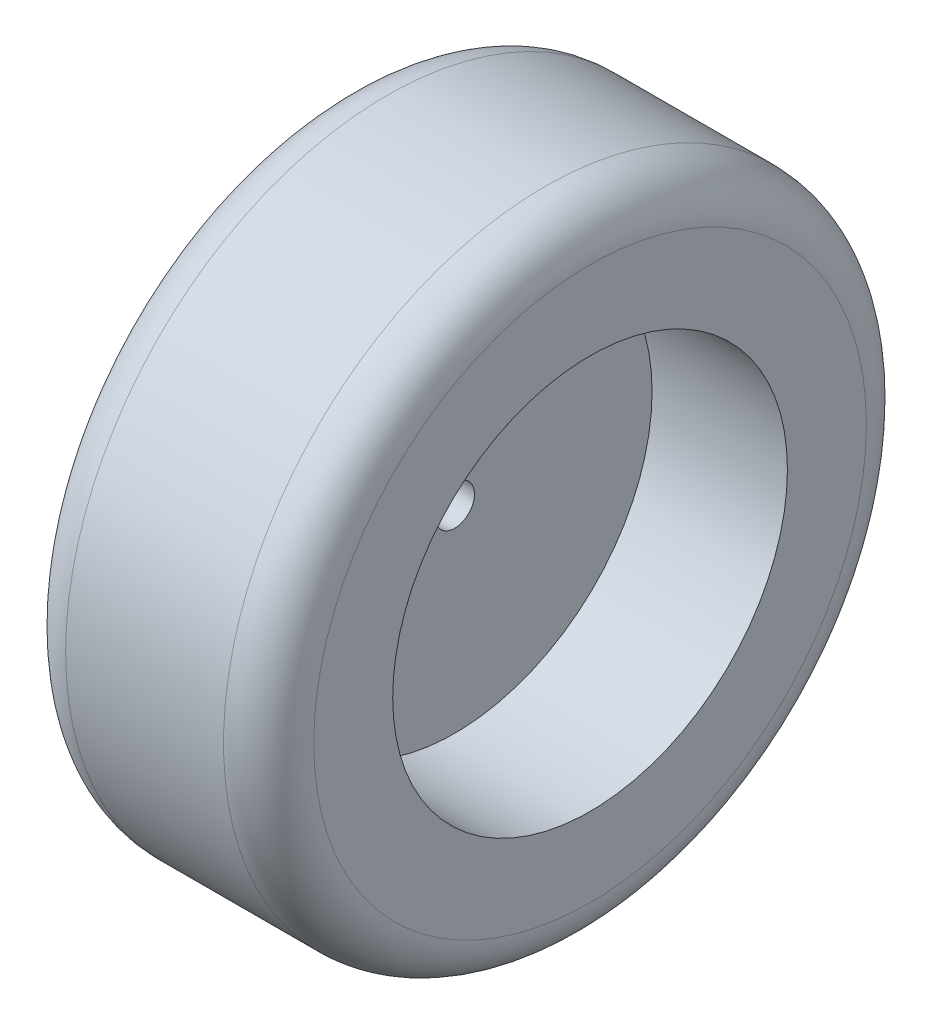
ISO-10303-21;
HEADER;
FILE_DESCRIPTION(('STEP AP214'),'2;1');
FILE_NAME('part.step','',(''),(''),'','','');
FILE_SCHEMA(('AUTOMOTIVE_DESIGN { 1 0 10303 214 1 1 1 1 }'));
ENDSEC;
DATA;
#1=APPLICATION_CONTEXT('core data for automotive mechanical design processes');
#2=APPLICATION_PROTOCOL_DEFINITION('international standard','automotive_design',2000,#1);
#3=PRODUCT_CONTEXT('',#1,'mechanical');
#4=PRODUCT('Part','Part','',(#3));
#5=PRODUCT_RELATED_PRODUCT_CATEGORY('part','',(#4));
#6=PRODUCT_DEFINITION_FORMATION('','',#4);
#7=PRODUCT_DEFINITION_CONTEXT('part definition',#1,'design');
#8=PRODUCT_DEFINITION('design','',#6,#7);
#9=PRODUCT_DEFINITION_SHAPE('','',#8);
#10=(LENGTH_UNIT() NAMED_UNIT(*) SI_UNIT(.MILLI.,.METRE.));
#11=(NAMED_UNIT(*) PLANE_ANGLE_UNIT() SI_UNIT($,.RADIAN.));
#12=(NAMED_UNIT(*) SI_UNIT($,.STERADIAN.) SOLID_ANGLE_UNIT());
#13=UNCERTAINTY_MEASURE_WITH_UNIT(LENGTH_MEASURE(1.E-05),#10,'distance_accuracy_value','');
#14=(GEOMETRIC_REPRESENTATION_CONTEXT(3) GLOBAL_UNCERTAINTY_ASSIGNED_CONTEXT((#13)) GLOBAL_UNIT_ASSIGNED_CONTEXT((#10,
#11,#12)) REPRESENTATION_CONTEXT('',''));
#15=CARTESIAN_POINT('',(0.,0.,0.));
#16=DIRECTION('',(0.,0.,1.));
#17=DIRECTION('',(1.,0.,0.));
#18=AXIS2_PLACEMENT_3D('',#15,#16,#17);
#19=CARTESIAN_POINT('',(11.,0.,0.));
#20=DIRECTION('',(1.,0.,0.));
#21=DIRECTION('',(0.,0.,-1.));
#22=AXIS2_PLACEMENT_3D('',#19,#20,#21);
#23=PLANE('',#22);
#24=CARTESIAN_POINT('',(11.,0.,0.));
#25=DIRECTION('',(1.,0.,0.));
#26=DIRECTION('',(0.,0.,-1.));
#27=AXIS2_PLACEMENT_3D('',#24,#25,#26);
#28=CIRCLE('',#27,17.5);
#29=CARTESIAN_POINT('',(11.,0.,-17.5));
#30=VERTEX_POINT('',#29);
#31=EDGE_CURVE('E58',#30,#30,#28,.T.);
#32=ORIENTED_EDGE('',*,*,#31,.F.);
#33=EDGE_LOOP('',(#32));
#34=FACE_BOUND('',#33,.T.);
#35=CARTESIAN_POINT('',(11.,0.,0.));
#36=DIRECTION('',(1.,0.,0.));
#37=DIRECTION('',(0.,0.,-1.));
#38=AXIS2_PLACEMENT_3D('',#35,#36,#37);
#39=CIRCLE('',#38,24.5);
#40=CARTESIAN_POINT('',(11.,0.,-24.5));
#41=VERTEX_POINT('',#40);
#42=EDGE_CURVE('E54',#41,#41,#39,.T.);
#43=ORIENTED_EDGE('',*,*,#42,.T.);
#44=EDGE_LOOP('',(#43));
#45=FACE_BOUND('',#44,.T.);
#46=ADVANCED_FACE('F37',(#34,#45),#23,.T.);
#47=CARTESIAN_POINT('',(-11.,0.,0.));
#48=DIRECTION('',(-1.,0.,0.));
#49=DIRECTION('',(0.,0.,1.));
#50=AXIS2_PLACEMENT_3D('',#47,#48,#49);
#51=PLANE('',#50);
#52=CARTESIAN_POINT('',(-11.,0.,0.));
#53=DIRECTION('',(-1.,0.,0.));
#54=DIRECTION('',(0.,0.,1.));
#55=AXIS2_PLACEMENT_3D('',#52,#53,#54);
#56=CIRCLE('',#55,17.5);
#57=CARTESIAN_POINT('',(-11.,0.,17.5));
#58=VERTEX_POINT('',#57);
#59=EDGE_CURVE('E66',#58,#58,#56,.T.);
#60=ORIENTED_EDGE('',*,*,#59,.F.);
#61=EDGE_LOOP('',(#60));
#62=FACE_BOUND('',#61,.T.);
#63=CARTESIAN_POINT('',(-11.,0.,0.));
#64=DIRECTION('',(-1.,0.,0.));
#65=DIRECTION('',(0.,0.,1.));
#66=AXIS2_PLACEMENT_3D('',#63,#64,#65);
#67=CIRCLE('',#66,24.5);
#68=CARTESIAN_POINT('',(-11.,0.,24.5));
#69=VERTEX_POINT('',#68);
#70=EDGE_CURVE('E11',#69,#69,#67,.T.);
#71=ORIENTED_EDGE('',*,*,#70,.T.);
#72=EDGE_LOOP('',(#71));
#73=FACE_BOUND('',#72,.T.);
#74=ADVANCED_FACE('F89',(#62,#73),#51,.T.);
#75=CARTESIAN_POINT('',(11.,0.,0.));
#76=DIRECTION('',(1.,0.,0.));
#77=DIRECTION('',(0.,0.,-1.));
#78=AXIS2_PLACEMENT_3D('',#75,#76,#77);
#79=CYLINDRICAL_SURFACE('',#78,28.5);
#80=CARTESIAN_POINT('',(7.00000000000001,0.,0.));
#81=DIRECTION('',(1.,0.,0.));
#82=DIRECTION('',(0.,0.,-1.));
#83=AXIS2_PLACEMENT_3D('',#80,#81,#82);
#84=CIRCLE('',#83,28.5);
#85=CARTESIAN_POINT('',(7.,0.,-28.5));
#86=VERTEX_POINT('',#85);
#87=EDGE_CURVE('E45',#86,#86,#84,.F.);
#88=ORIENTED_EDGE('',*,*,#87,.T.);
#89=EDGE_LOOP('',(#88));
#90=FACE_BOUND('',#89,.T.);
#91=CARTESIAN_POINT('',(-6.99999999999999,0.,0.));
#92=DIRECTION('',(-1.,0.,0.));
#93=DIRECTION('',(0.,0.,1.));
#94=AXIS2_PLACEMENT_3D('',#91,#92,#93);
#95=CIRCLE('',#94,28.5);
#96=CARTESIAN_POINT('',(-6.99999999999999,0.,28.5));
#97=VERTEX_POINT('',#96);
#98=EDGE_CURVE('E49',#97,#97,#95,.F.);
#99=ORIENTED_EDGE('',*,*,#98,.T.);
#100=EDGE_LOOP('',(#99));
#101=FACE_BOUND('',#100,.T.);
#102=ADVANCED_FACE('F95',(#90,#101),#79,.T.);
#103=CARTESIAN_POINT('',(7.00000000000001,0.,0.));
#104=DIRECTION('',(1.,0.,0.));
#105=DIRECTION('',(0.,0.,-1.));
#106=AXIS2_PLACEMENT_3D('',#103,#104,#105);
#107=TOROIDAL_SURFACE('',#106,24.5,4.);
#108=ORIENTED_EDGE('',*,*,#87,.F.);
#109=EDGE_LOOP('',(#108));
#110=FACE_BOUND('',#109,.T.);
#111=ORIENTED_EDGE('',*,*,#42,.F.);
#112=EDGE_LOOP('',(#111));
#113=FACE_BOUND('',#112,.T.);
#114=ADVANCED_FACE('F101',(#110,#113),#107,.T.);
#115=CARTESIAN_POINT('',(-6.99999999999999,0.,0.));
#116=DIRECTION('',(-1.,0.,0.));
#117=DIRECTION('',(0.,0.,1.));
#118=AXIS2_PLACEMENT_3D('',#115,#116,#117);
#119=TOROIDAL_SURFACE('',#118,24.5,4.);
#120=ORIENTED_EDGE('',*,*,#70,.F.);
#121=EDGE_LOOP('',(#120));
#122=FACE_BOUND('',#121,.T.);
#123=ORIENTED_EDGE('',*,*,#98,.F.);
#124=EDGE_LOOP('',(#123));
#125=FACE_BOUND('',#124,.T.);
#126=ADVANCED_FACE('F39',(#122,#125),#119,.T.);
#127=CARTESIAN_POINT('',(-0.999999999999994,0.,0.));
#128=DIRECTION('',(1.,0.,0.));
#129=DIRECTION('',(0.,0.,-1.));
#130=AXIS2_PLACEMENT_3D('',#127,#128,#129);
#131=CYLINDRICAL_SURFACE('',#130,17.5);
#132=CARTESIAN_POINT('',(-0.999999999999994,0.,0.));
#133=DIRECTION('',(1.,0.,0.));
#134=DIRECTION('',(0.,0.,-1.));
#135=AXIS2_PLACEMENT_3D('',#132,#133,#134);
#136=CIRCLE('',#135,17.5);
#137=CARTESIAN_POINT('',(-0.999999999999996,0.,-17.5));
#138=VERTEX_POINT('',#137);
#139=EDGE_CURVE('E57',#138,#138,#136,.T.);
#140=ORIENTED_EDGE('',*,*,#139,.F.);
#141=EDGE_LOOP('',(#140));
#142=FACE_BOUND('',#141,.T.);
#143=ORIENTED_EDGE('',*,*,#31,.T.);
#144=EDGE_LOOP('',(#143));
#145=FACE_BOUND('',#144,.T.);
#146=ADVANCED_FACE('F108',(#142,#145),#131,.F.);
#147=CARTESIAN_POINT('',(-0.999999999999994,0.,0.));
#148=DIRECTION('',(1.,0.,0.));
#149=DIRECTION('',(0.,0.,-1.));
#150=AXIS2_PLACEMENT_3D('',#147,#148,#149);
#151=PLANE('',#150);
#152=CARTESIAN_POINT('',(-0.999999999999994,0.,0.));
#153=DIRECTION('',(1.,0.,0.));
#154=DIRECTION('',(0.,0.,-1.));
#155=AXIS2_PLACEMENT_3D('',#152,#153,#154);
#156=CIRCLE('',#155,1.75);
#157=CARTESIAN_POINT('',(-0.999999999999994,0.,-1.75));
#158=VERTEX_POINT('',#157);
#159=EDGE_CURVE('E69',#158,#158,#156,.T.);
#160=ORIENTED_EDGE('',*,*,#159,.F.);
#161=EDGE_LOOP('',(#160));
#162=FACE_BOUND('',#161,.T.);
#163=ORIENTED_EDGE('',*,*,#139,.T.);
#164=EDGE_LOOP('',(#163));
#165=FACE_BOUND('',#164,.T.);
#166=ADVANCED_FACE('F122',(#162,#165),#151,.T.);
#167=CARTESIAN_POINT('',(-2.99999999999999,0.,0.));
#168=DIRECTION('',(1.,0.,0.));
#169=DIRECTION('',(0.,0.,-1.));
#170=AXIS2_PLACEMENT_3D('',#167,#168,#169);
#171=PLANE('',#170);
#172=CARTESIAN_POINT('',(-2.99999999999999,0.,0.));
#173=DIRECTION('',(1.,0.,0.));
#174=DIRECTION('',(0.,0.,-1.));
#175=AXIS2_PLACEMENT_3D('',#172,#173,#174);
#176=CIRCLE('',#175,1.75);
#177=CARTESIAN_POINT('',(-2.99999999999999,0.,-1.75));
#178=VERTEX_POINT('',#177);
#179=EDGE_CURVE('E41',#178,#178,#176,.T.);
#180=ORIENTED_EDGE('',*,*,#179,.T.);
#181=EDGE_LOOP('',(#180));
#182=FACE_BOUND('',#181,.T.);
#183=CARTESIAN_POINT('',(-3.,0.,0.));
#184=DIRECTION('',(1.,0.,0.));
#185=DIRECTION('',(0.,0.,-1.));
#186=AXIS2_PLACEMENT_3D('',#183,#184,#185);
#187=CIRCLE('',#186,17.5);
#188=CARTESIAN_POINT('',(-3.,0.,-17.5));
#189=VERTEX_POINT('',#188);
#190=EDGE_CURVE('E61',#189,#189,#187,.F.);
#191=ORIENTED_EDGE('',*,*,#190,.T.);
#192=EDGE_LOOP('',(#191));
#193=FACE_BOUND('',#192,.T.);
#194=ADVANCED_FACE('F76',(#182,#193),#171,.F.);
#195=CARTESIAN_POINT('',(48.4974746830583,0.,0.));
#196=DIRECTION('',(-1.,0.,0.));
#197=DIRECTION('',(0.,0.,1.));
#198=AXIS2_PLACEMENT_3D('',#195,#196,#197);
#199=CYLINDRICAL_SURFACE('',#198,17.5);
#200=ORIENTED_EDGE('',*,*,#59,.T.);
#201=EDGE_LOOP('',(#200));
#202=FACE_BOUND('',#201,.T.);
#203=ORIENTED_EDGE('',*,*,#190,.F.);
#204=EDGE_LOOP('',(#203));
#205=FACE_BOUND('',#204,.T.);
#206=ADVANCED_FACE('F81',(#202,#205),#199,.F.);
#207=CARTESIAN_POINT('',(-11.,0.,0.));
#208=DIRECTION('',(1.,0.,0.));
#209=DIRECTION('',(0.,0.,-1.));
#210=AXIS2_PLACEMENT_3D('',#207,#208,#209);
#211=CYLINDRICAL_SURFACE('',#210,1.75);
#212=ORIENTED_EDGE('',*,*,#159,.T.);
#213=EDGE_LOOP('',(#212));
#214=FACE_BOUND('',#213,.T.);
#215=ORIENTED_EDGE('',*,*,#179,.F.);
#216=EDGE_LOOP('',(#215));
#217=FACE_BOUND('',#216,.T.);
#218=ADVANCED_FACE('F79',(#214,#217),#211,.F.);
#219=CLOSED_SHELL('',(#46,#74,#102,#114,#126,#146,#166,#194,#206,#218));
#220=MANIFOLD_SOLID_BREP('B2',#219);
#221=ADVANCED_BREP_SHAPE_REPRESENTATION('',(#18,#220),#14);
#222=SHAPE_DEFINITION_REPRESENTATION(#9,#221);
ENDSEC;
END-ISO-10303-21;
